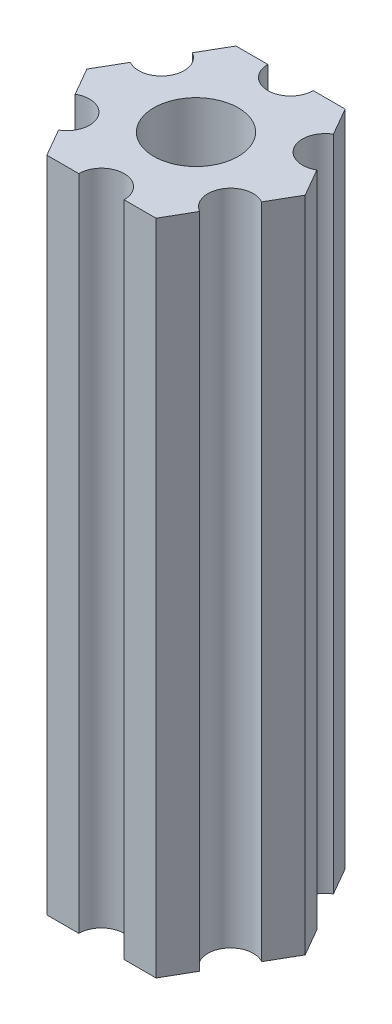
ISO-10303-21;
HEADER;
FILE_DESCRIPTION(('STEP AP214'),'2;1');
FILE_NAME('part.step','',(''),(''),'','','');
FILE_SCHEMA(('AUTOMOTIVE_DESIGN { 1 0 10303 214 1 1 1 1 }'));
ENDSEC;
DATA;
#1=APPLICATION_CONTEXT('core data for automotive mechanical design processes');
#2=APPLICATION_PROTOCOL_DEFINITION('international standard','automotive_design',2000,#1);
#3=PRODUCT_CONTEXT('',#1,'mechanical');
#4=PRODUCT('Part','Part','',(#3));
#5=PRODUCT_RELATED_PRODUCT_CATEGORY('part','',(#4));
#6=PRODUCT_DEFINITION_FORMATION('','',#4);
#7=PRODUCT_DEFINITION_CONTEXT('part definition',#1,'design');
#8=PRODUCT_DEFINITION('design','',#6,#7);
#9=PRODUCT_DEFINITION_SHAPE('','',#8);
#10=(LENGTH_UNIT() NAMED_UNIT(*) SI_UNIT(.MILLI.,.METRE.));
#11=(NAMED_UNIT(*) PLANE_ANGLE_UNIT() SI_UNIT($,.RADIAN.));
#12=(NAMED_UNIT(*) SI_UNIT($,.STERADIAN.) SOLID_ANGLE_UNIT());
#13=UNCERTAINTY_MEASURE_WITH_UNIT(LENGTH_MEASURE(1.E-05),#10,'distance_accuracy_value','');
#14=(GEOMETRIC_REPRESENTATION_CONTEXT(3) GLOBAL_UNCERTAINTY_ASSIGNED_CONTEXT((#13)) GLOBAL_UNIT_ASSIGNED_CONTEXT((#10,
#11,#12)) REPRESENTATION_CONTEXT('',''));
#15=CARTESIAN_POINT('',(0.,0.,0.));
#16=DIRECTION('',(0.,0.,1.));
#17=DIRECTION('',(1.,0.,0.));
#18=AXIS2_PLACEMENT_3D('',#15,#16,#17);
#19=CARTESIAN_POINT('',(5.41265877365274,41.5,3.125));
#20=DIRECTION('',(0.,1.,0.));
#21=DIRECTION('',(0.,0.,1.));
#22=AXIS2_PLACEMENT_3D('',#19,#20,#21);
#23=CYLINDRICAL_SURFACE('',#22,1.5);
#24=CARTESIAN_POINT('',(5.41265877365274,85.,3.125));
#25=DIRECTION('',(0.,-1.,0.));
#26=DIRECTION('',(0.,0.,-1.));
#27=AXIS2_PLACEMENT_3D('',#24,#25,#26);
#28=CIRCLE('',#27,1.5);
#29=CARTESIAN_POINT('',(4.66265877365274,85.,4.42403810567666));
#30=VERTEX_POINT('',#29);
#31=CARTESIAN_POINT('',(6.16265877365274,85.,1.82596189432335));
#32=VERTEX_POINT('',#31);
#33=EDGE_CURVE('E190',#30,#32,#28,.T.);
#34=ORIENTED_EDGE('',*,*,#33,.F.);
#35=DIRECTION('',(0.,1.,0.));
#36=VECTOR('',#35,1.);
#37=CARTESIAN_POINT('',(4.66265877365274,41.5,4.42403810567666));
#38=LINE('',#37,#36);
#39=CARTESIAN_POINT('',(4.66265877365274,41.5,4.42403810567666));
#40=VERTEX_POINT('',#39);
#41=EDGE_CURVE('E11',#40,#30,#38,.T.);
#42=ORIENTED_EDGE('',*,*,#41,.F.);
#43=CARTESIAN_POINT('',(5.41265877365274,41.5,3.125));
#44=DIRECTION('',(0.,-1.,0.));
#45=DIRECTION('',(0.,0.,-1.));
#46=AXIS2_PLACEMENT_3D('',#43,#44,#45);
#47=CIRCLE('',#46,1.5);
#48=CARTESIAN_POINT('',(6.16265877365274,41.5,1.82596189432335));
#49=VERTEX_POINT('',#48);
#50=EDGE_CURVE('E241',#40,#49,#47,.T.);
#51=ORIENTED_EDGE('',*,*,#50,.T.);
#52=DIRECTION('',(0.,1.,0.));
#53=VECTOR('',#52,1.);
#54=CARTESIAN_POINT('',(6.16265877365274,41.5,1.82596189432335));
#55=LINE('',#54,#53);
#56=EDGE_CURVE('E36',#49,#32,#55,.T.);
#57=ORIENTED_EDGE('',*,*,#56,.T.);
#58=EDGE_LOOP('',(#34,#42,#51,#57));
#59=FACE_BOUND('',#58,.T.);
#60=ADVANCED_FACE('F33',(#59),#23,.F.);
#61=CARTESIAN_POINT('',(3.60843918243516,41.5,6.25));
#62=DIRECTION('',(0.866025403784439,0.,0.5));
#63=DIRECTION('',(0.5,0.,-0.866025403784439));
#64=AXIS2_PLACEMENT_3D('',#61,#62,#63);
#65=PLANE('',#64);
#66=DIRECTION('',(0.5,0.,-0.866025403784439));
#67=VECTOR('',#66,1.);
#68=CARTESIAN_POINT('',(3.60843918243516,85.,6.25));
#69=LINE('',#68,#67);
#70=CARTESIAN_POINT('',(3.60843918243516,85.,6.25));
#71=VERTEX_POINT('',#70);
#72=EDGE_CURVE('E239',#71,#30,#69,.T.);
#73=ORIENTED_EDGE('',*,*,#72,.F.);
#74=DIRECTION('',(0.,1.,0.));
#75=VECTOR('',#74,1.);
#76=CARTESIAN_POINT('',(3.60843918243516,41.5,6.25));
#77=LINE('',#76,#75);
#78=CARTESIAN_POINT('',(3.60843918243516,41.5,6.25));
#79=VERTEX_POINT('',#78);
#80=EDGE_CURVE('E42',#79,#71,#77,.T.);
#81=ORIENTED_EDGE('',*,*,#80,.F.);
#82=DIRECTION('',(0.5,0.,-0.866025403784439));
#83=VECTOR('',#82,1.);
#84=CARTESIAN_POINT('',(3.60843918243516,41.5,6.25));
#85=LINE('',#84,#83);
#86=EDGE_CURVE('E180',#79,#40,#85,.T.);
#87=ORIENTED_EDGE('',*,*,#86,.T.);
#88=ORIENTED_EDGE('',*,*,#41,.T.);
#89=EDGE_LOOP('',(#73,#81,#87,#88));
#90=FACE_BOUND('',#89,.T.);
#91=ADVANCED_FACE('F273',(#90),#65,.T.);
#92=CARTESIAN_POINT('',(1.5,41.5,6.25));
#93=DIRECTION('',(0.,0.,1.));
#94=DIRECTION('',(1.,0.,0.));
#95=AXIS2_PLACEMENT_3D('',#92,#93,#94);
#96=PLANE('',#95);
#97=DIRECTION('',(1.,0.,0.));
#98=VECTOR('',#97,1.);
#99=CARTESIAN_POINT('',(1.5,85.,6.25));
#100=LINE('',#99,#98);
#101=CARTESIAN_POINT('',(1.5,85.,6.25));
#102=VERTEX_POINT('',#101);
#103=EDGE_CURVE('E167',#102,#71,#100,.T.);
#104=ORIENTED_EDGE('',*,*,#103,.F.);
#105=DIRECTION('',(0.,1.,0.));
#106=VECTOR('',#105,1.);
#107=CARTESIAN_POINT('',(1.5,41.5,6.25));
#108=LINE('',#107,#106);
#109=CARTESIAN_POINT('',(1.5,41.5,6.25));
#110=VERTEX_POINT('',#109);
#111=EDGE_CURVE('E162',#110,#102,#108,.T.);
#112=ORIENTED_EDGE('',*,*,#111,.F.);
#113=DIRECTION('',(1.,0.,0.));
#114=VECTOR('',#113,1.);
#115=CARTESIAN_POINT('',(1.5,41.5,6.25));
#116=LINE('',#115,#114);
#117=EDGE_CURVE('E165',#110,#79,#116,.T.);
#118=ORIENTED_EDGE('',*,*,#117,.T.);
#119=ORIENTED_EDGE('',*,*,#80,.T.);
#120=EDGE_LOOP('',(#104,#112,#118,#119));
#121=FACE_BOUND('',#120,.T.);
#122=ADVANCED_FACE('F164',(#121),#96,.T.);
#123=CARTESIAN_POINT('',(0.,41.5,6.25));
#124=DIRECTION('',(0.,1.,0.));
#125=DIRECTION('',(0.,0.,1.));
#126=AXIS2_PLACEMENT_3D('',#123,#124,#125);
#127=CYLINDRICAL_SURFACE('',#126,1.5);
#128=CARTESIAN_POINT('',(0.,85.,6.25));
#129=DIRECTION('',(0.,-1.,0.));
#130=DIRECTION('',(0.,0.,-1.));
#131=AXIS2_PLACEMENT_3D('',#128,#129,#130);
#132=CIRCLE('',#131,1.5);
#133=CARTESIAN_POINT('',(-1.5,85.,6.25));
#134=VERTEX_POINT('',#133);
#135=EDGE_CURVE('E236',#134,#102,#132,.T.);
#136=ORIENTED_EDGE('',*,*,#135,.F.);
#137=DIRECTION('',(0.,1.,0.));
#138=VECTOR('',#137,1.);
#139=CARTESIAN_POINT('',(-1.5,41.5,6.25));
#140=LINE('',#139,#138);
#141=CARTESIAN_POINT('',(-1.5,41.5,6.25));
#142=VERTEX_POINT('',#141);
#143=EDGE_CURVE('E172',#142,#134,#140,.T.);
#144=ORIENTED_EDGE('',*,*,#143,.F.);
#145=CARTESIAN_POINT('',(0.,41.5,6.25));
#146=DIRECTION('',(0.,-1.,0.));
#147=DIRECTION('',(0.,0.,-1.));
#148=AXIS2_PLACEMENT_3D('',#145,#146,#147);
#149=CIRCLE('',#148,1.5);
#150=EDGE_CURVE('E178',#142,#110,#149,.T.);
#151=ORIENTED_EDGE('',*,*,#150,.T.);
#152=ORIENTED_EDGE('',*,*,#111,.T.);
#153=EDGE_LOOP('',(#136,#144,#151,#152));
#154=FACE_BOUND('',#153,.T.);
#155=ADVANCED_FACE('F182',(#154),#127,.F.);
#156=CARTESIAN_POINT('',(-3.60843918243516,41.5,6.25));
#157=DIRECTION('',(0.,0.,1.));
#158=DIRECTION('',(1.,0.,0.));
#159=AXIS2_PLACEMENT_3D('',#156,#157,#158);
#160=PLANE('',#159);
#161=DIRECTION('',(1.,0.,0.));
#162=VECTOR('',#161,1.);
#163=CARTESIAN_POINT('',(-3.60843918243516,85.,6.25));
#164=LINE('',#163,#162);
#165=CARTESIAN_POINT('',(-3.60843918243516,85.,6.25));
#166=VERTEX_POINT('',#165);
#167=EDGE_CURVE('E233',#166,#134,#164,.T.);
#168=ORIENTED_EDGE('',*,*,#167,.F.);
#169=DIRECTION('',(0.,1.,0.));
#170=VECTOR('',#169,1.);
#171=CARTESIAN_POINT('',(-3.60843918243516,41.5,6.25));
#172=LINE('',#171,#170);
#173=CARTESIAN_POINT('',(-3.60843918243516,41.5,6.25));
#174=VERTEX_POINT('',#173);
#175=EDGE_CURVE('E245',#174,#166,#172,.T.);
#176=ORIENTED_EDGE('',*,*,#175,.F.);
#177=DIRECTION('',(1.,0.,0.));
#178=VECTOR('',#177,1.);
#179=CARTESIAN_POINT('',(-3.60843918243516,41.5,6.25));
#180=LINE('',#179,#178);
#181=EDGE_CURVE('E183',#174,#142,#180,.T.);
#182=ORIENTED_EDGE('',*,*,#181,.T.);
#183=ORIENTED_EDGE('',*,*,#143,.T.);
#184=EDGE_LOOP('',(#168,#176,#182,#183));
#185=FACE_BOUND('',#184,.T.);
#186=ADVANCED_FACE('F286',(#185),#160,.T.);
#187=CARTESIAN_POINT('',(-4.66265877365274,41.5,4.42403810567666));
#188=DIRECTION('',(-0.866025403784439,0.,0.5));
#189=DIRECTION('',(0.5,0.,0.866025403784439));
#190=AXIS2_PLACEMENT_3D('',#187,#188,#189);
#191=PLANE('',#190);
#192=DIRECTION('',(0.5,0.,0.866025403784439));
#193=VECTOR('',#192,1.);
#194=CARTESIAN_POINT('',(-4.66265877365274,85.,4.42403810567666));
#195=LINE('',#194,#193);
#196=CARTESIAN_POINT('',(-4.66265877365274,85.,4.42403810567666));
#197=VERTEX_POINT('',#196);
#198=EDGE_CURVE('E230',#197,#166,#195,.T.);
#199=ORIENTED_EDGE('',*,*,#198,.F.);
#200=DIRECTION('',(0.,1.,0.));
#201=VECTOR('',#200,1.);
#202=CARTESIAN_POINT('',(-4.66265877365274,41.5,4.42403810567666));
#203=LINE('',#202,#201);
#204=CARTESIAN_POINT('',(-4.66265877365274,41.5,4.42403810567666));
#205=VERTEX_POINT('',#204);
#206=EDGE_CURVE('E247',#205,#197,#203,.T.);
#207=ORIENTED_EDGE('',*,*,#206,.F.);
#208=DIRECTION('',(0.5,0.,0.866025403784439));
#209=VECTOR('',#208,1.);
#210=CARTESIAN_POINT('',(-4.66265877365274,41.5,4.42403810567666));
#211=LINE('',#210,#209);
#212=EDGE_CURVE('E185',#205,#174,#211,.T.);
#213=ORIENTED_EDGE('',*,*,#212,.T.);
#214=ORIENTED_EDGE('',*,*,#175,.T.);
#215=EDGE_LOOP('',(#199,#207,#213,#214));
#216=FACE_BOUND('',#215,.T.);
#217=ADVANCED_FACE('F289',(#216),#191,.T.);
#218=CARTESIAN_POINT('',(-5.41265877365274,41.5,3.125));
#219=DIRECTION('',(0.,1.,0.));
#220=DIRECTION('',(0.,0.,1.));
#221=AXIS2_PLACEMENT_3D('',#218,#219,#220);
#222=CYLINDRICAL_SURFACE('',#221,1.5);
#223=CARTESIAN_POINT('',(-5.41265877365274,85.,3.125));
#224=DIRECTION('',(0.,-1.,0.));
#225=DIRECTION('',(0.,0.,-1.));
#226=AXIS2_PLACEMENT_3D('',#223,#224,#225);
#227=CIRCLE('',#226,1.5);
#228=CARTESIAN_POINT('',(-6.16265877365274,85.,1.82596189432335));
#229=VERTEX_POINT('',#228);
#230=EDGE_CURVE('E227',#229,#197,#227,.T.);
#231=ORIENTED_EDGE('',*,*,#230,.F.);
#232=DIRECTION('',(0.,1.,0.));
#233=VECTOR('',#232,1.);
#234=CARTESIAN_POINT('',(-6.16265877365274,41.5,1.82596189432335));
#235=LINE('',#234,#233);
#236=CARTESIAN_POINT('',(-6.16265877365274,41.5,1.82596189432335));
#237=VERTEX_POINT('',#236);
#238=EDGE_CURVE('E249',#237,#229,#235,.T.);
#239=ORIENTED_EDGE('',*,*,#238,.F.);
#240=CARTESIAN_POINT('',(-5.41265877365274,41.5,3.125));
#241=DIRECTION('',(0.,-1.,0.));
#242=DIRECTION('',(0.,0.,-1.));
#243=AXIS2_PLACEMENT_3D('',#240,#241,#242);
#244=CIRCLE('',#243,1.5);
#245=EDGE_CURVE('E394',#237,#205,#244,.T.);
#246=ORIENTED_EDGE('',*,*,#245,.T.);
#247=ORIENTED_EDGE('',*,*,#206,.T.);
#248=EDGE_LOOP('',(#231,#239,#246,#247));
#249=FACE_BOUND('',#248,.T.);
#250=ADVANCED_FACE('F293',(#249),#222,.F.);
#251=CARTESIAN_POINT('',(-7.21687836487032,41.5,0.));
#252=DIRECTION('',(-0.86602540378444,0.,0.499999999999998));
#253=DIRECTION('',(0.499999999999998,0.,0.86602540378444));
#254=AXIS2_PLACEMENT_3D('',#251,#252,#253);
#255=PLANE('',#254);
#256=DIRECTION('',(0.499999999999998,0.,0.86602540378444));
#257=VECTOR('',#256,1.);
#258=CARTESIAN_POINT('',(-7.21687836487032,85.,0.));
#259=LINE('',#258,#257);
#260=CARTESIAN_POINT('',(-7.21687836487032,85.,0.));
#261=VERTEX_POINT('',#260);
#262=EDGE_CURVE('E224',#261,#229,#259,.T.);
#263=ORIENTED_EDGE('',*,*,#262,.F.);
#264=DIRECTION('',(0.,1.,0.));
#265=VECTOR('',#264,1.);
#266=CARTESIAN_POINT('',(-7.21687836487032,41.5,0.));
#267=LINE('',#266,#265);
#268=CARTESIAN_POINT('',(-7.21687836487032,41.5,0.));
#269=VERTEX_POINT('',#268);
#270=EDGE_CURVE('E251',#269,#261,#267,.T.);
#271=ORIENTED_EDGE('',*,*,#270,.F.);
#272=DIRECTION('',(0.499999999999998,0.,0.86602540378444));
#273=VECTOR('',#272,1.);
#274=CARTESIAN_POINT('',(-7.21687836487032,41.5,0.));
#275=LINE('',#274,#273);
#276=EDGE_CURVE('E391',#269,#237,#275,.T.);
#277=ORIENTED_EDGE('',*,*,#276,.T.);
#278=ORIENTED_EDGE('',*,*,#238,.T.);
#279=EDGE_LOOP('',(#263,#271,#277,#278));
#280=FACE_BOUND('',#279,.T.);
#281=ADVANCED_FACE('F297',(#280),#255,.T.);
#282=CARTESIAN_POINT('',(-6.16265877365274,41.5,-1.82596189432334));
#283=DIRECTION('',(-0.866025403784438,0.,-0.5));
#284=DIRECTION('',(-0.5,0.,0.866025403784439));
#285=AXIS2_PLACEMENT_3D('',#282,#283,#284);
#286=PLANE('',#285);
#287=DIRECTION('',(-0.5,0.,0.866025403784438));
#288=VECTOR('',#287,1.);
#289=CARTESIAN_POINT('',(-6.16265877365274,85.,-1.82596189432334));
#290=LINE('',#289,#288);
#291=CARTESIAN_POINT('',(-6.16265877365274,85.,-1.82596189432334));
#292=VERTEX_POINT('',#291);
#293=EDGE_CURVE('E221',#292,#261,#290,.T.);
#294=ORIENTED_EDGE('',*,*,#293,.F.);
#295=DIRECTION('',(0.,1.,0.));
#296=VECTOR('',#295,1.);
#297=CARTESIAN_POINT('',(-6.16265877365274,41.5,-1.82596189432334));
#298=LINE('',#297,#296);
#299=CARTESIAN_POINT('',(-6.16265877365274,41.5,-1.82596189432334));
#300=VERTEX_POINT('',#299);
#301=EDGE_CURVE('E253',#300,#292,#298,.T.);
#302=ORIENTED_EDGE('',*,*,#301,.F.);
#303=DIRECTION('',(-0.5,0.,0.866025403784438));
#304=VECTOR('',#303,1.);
#305=CARTESIAN_POINT('',(-6.16265877365274,41.5,-1.82596189432334));
#306=LINE('',#305,#304);
#307=EDGE_CURVE('E388',#300,#269,#306,.T.);
#308=ORIENTED_EDGE('',*,*,#307,.T.);
#309=ORIENTED_EDGE('',*,*,#270,.T.);
#310=EDGE_LOOP('',(#294,#302,#308,#309));
#311=FACE_BOUND('',#310,.T.);
#312=ADVANCED_FACE('F301',(#311),#286,.T.);
#313=CARTESIAN_POINT('',(-5.41265877365274,41.5,-3.125));
#314=DIRECTION('',(0.,1.,0.));
#315=DIRECTION('',(0.,0.,1.));
#316=AXIS2_PLACEMENT_3D('',#313,#314,#315);
#317=CYLINDRICAL_SURFACE('',#316,1.5);
#318=CARTESIAN_POINT('',(-5.41265877365274,85.,-3.125));
#319=DIRECTION('',(0.,-1.,0.));
#320=DIRECTION('',(0.,0.,-1.));
#321=AXIS2_PLACEMENT_3D('',#318,#319,#320);
#322=CIRCLE('',#321,1.5);
#323=CARTESIAN_POINT('',(-4.66265877365274,85.,-4.42403810567666));
#324=VERTEX_POINT('',#323);
#325=EDGE_CURVE('E218',#324,#292,#322,.T.);
#326=ORIENTED_EDGE('',*,*,#325,.F.);
#327=DIRECTION('',(0.,1.,0.));
#328=VECTOR('',#327,1.);
#329=CARTESIAN_POINT('',(-4.66265877365274,41.5,-4.42403810567666));
#330=LINE('',#329,#328);
#331=CARTESIAN_POINT('',(-4.66265877365274,41.5,-4.42403810567666));
#332=VERTEX_POINT('',#331);
#333=EDGE_CURVE('E255',#332,#324,#330,.T.);
#334=ORIENTED_EDGE('',*,*,#333,.F.);
#335=CARTESIAN_POINT('',(-5.41265877365274,41.5,-3.125));
#336=DIRECTION('',(0.,-1.,0.));
#337=DIRECTION('',(0.,0.,-1.));
#338=AXIS2_PLACEMENT_3D('',#335,#336,#337);
#339=CIRCLE('',#338,1.5);
#340=EDGE_CURVE('E385',#332,#300,#339,.T.);
#341=ORIENTED_EDGE('',*,*,#340,.T.);
#342=ORIENTED_EDGE('',*,*,#301,.T.);
#343=EDGE_LOOP('',(#326,#334,#341,#342));
#344=FACE_BOUND('',#343,.T.);
#345=ADVANCED_FACE('F305',(#344),#317,.F.);
#346=CARTESIAN_POINT('',(-3.60843918243516,41.5,-6.25));
#347=DIRECTION('',(-0.866025403784439,0.,-0.5));
#348=DIRECTION('',(-0.5,0.,0.866025403784439));
#349=AXIS2_PLACEMENT_3D('',#346,#347,#348);
#350=PLANE('',#349);
#351=DIRECTION('',(-0.5,0.,0.866025403784439));
#352=VECTOR('',#351,1.);
#353=CARTESIAN_POINT('',(-3.60843918243516,85.,-6.25));
#354=LINE('',#353,#352);
#355=CARTESIAN_POINT('',(-3.60843918243516,85.,-6.25));
#356=VERTEX_POINT('',#355);
#357=EDGE_CURVE('E215',#356,#324,#354,.T.);
#358=ORIENTED_EDGE('',*,*,#357,.F.);
#359=DIRECTION('',(0.,1.,0.));
#360=VECTOR('',#359,1.);
#361=CARTESIAN_POINT('',(-3.60843918243516,41.5,-6.25));
#362=LINE('',#361,#360);
#363=CARTESIAN_POINT('',(-3.60843918243516,41.5,-6.25));
#364=VERTEX_POINT('',#363);
#365=EDGE_CURVE('E257',#364,#356,#362,.T.);
#366=ORIENTED_EDGE('',*,*,#365,.F.);
#367=DIRECTION('',(-0.5,0.,0.866025403784439));
#368=VECTOR('',#367,1.);
#369=CARTESIAN_POINT('',(-3.60843918243516,41.5,-6.25));
#370=LINE('',#369,#368);
#371=EDGE_CURVE('E382',#364,#332,#370,.T.);
#372=ORIENTED_EDGE('',*,*,#371,.T.);
#373=ORIENTED_EDGE('',*,*,#333,.T.);
#374=EDGE_LOOP('',(#358,#366,#372,#373));
#375=FACE_BOUND('',#374,.T.);
#376=ADVANCED_FACE('F309',(#375),#350,.T.);
#377=CARTESIAN_POINT('',(-1.5,41.5,-6.25));
#378=DIRECTION('',(0.,0.,-1.));
#379=DIRECTION('',(-1.,0.,0.));
#380=AXIS2_PLACEMENT_3D('',#377,#378,#379);
#381=PLANE('',#380);
#382=DIRECTION('',(-1.,0.,0.));
#383=VECTOR('',#382,1.);
#384=CARTESIAN_POINT('',(-1.5,85.,-6.25));
#385=LINE('',#384,#383);
#386=CARTESIAN_POINT('',(-1.5,85.,-6.25));
#387=VERTEX_POINT('',#386);
#388=EDGE_CURVE('E212',#387,#356,#385,.T.);
#389=ORIENTED_EDGE('',*,*,#388,.F.);
#390=DIRECTION('',(0.,1.,0.));
#391=VECTOR('',#390,1.);
#392=CARTESIAN_POINT('',(-1.5,41.5,-6.25));
#393=LINE('',#392,#391);
#394=CARTESIAN_POINT('',(-1.5,41.5,-6.25));
#395=VERTEX_POINT('',#394);
#396=EDGE_CURVE('E259',#395,#387,#393,.T.);
#397=ORIENTED_EDGE('',*,*,#396,.F.);
#398=DIRECTION('',(-1.,0.,0.));
#399=VECTOR('',#398,1.);
#400=CARTESIAN_POINT('',(-1.5,41.5,-6.25));
#401=LINE('',#400,#399);
#402=EDGE_CURVE('E379',#395,#364,#401,.T.);
#403=ORIENTED_EDGE('',*,*,#402,.T.);
#404=ORIENTED_EDGE('',*,*,#365,.T.);
#405=EDGE_LOOP('',(#389,#397,#403,#404));
#406=FACE_BOUND('',#405,.T.);
#407=ADVANCED_FACE('F313',(#406),#381,.T.);
#408=CARTESIAN_POINT('',(0.,41.5,-6.25));
#409=DIRECTION('',(0.,1.,0.));
#410=DIRECTION('',(0.,0.,1.));
#411=AXIS2_PLACEMENT_3D('',#408,#409,#410);
#412=CYLINDRICAL_SURFACE('',#411,1.5);
#413=CARTESIAN_POINT('',(0.,85.,-6.25));
#414=DIRECTION('',(0.,-1.,0.));
#415=DIRECTION('',(0.,0.,-1.));
#416=AXIS2_PLACEMENT_3D('',#413,#414,#415);
#417=CIRCLE('',#416,1.5);
#418=CARTESIAN_POINT('',(1.5,85.,-6.25));
#419=VERTEX_POINT('',#418);
#420=EDGE_CURVE('E209',#419,#387,#417,.T.);
#421=ORIENTED_EDGE('',*,*,#420,.F.);
#422=DIRECTION('',(0.,1.,0.));
#423=VECTOR('',#422,1.);
#424=CARTESIAN_POINT('',(1.5,41.5,-6.25));
#425=LINE('',#424,#423);
#426=CARTESIAN_POINT('',(1.5,41.5,-6.25));
#427=VERTEX_POINT('',#426);
#428=EDGE_CURVE('E261',#427,#419,#425,.T.);
#429=ORIENTED_EDGE('',*,*,#428,.F.);
#430=CARTESIAN_POINT('',(0.,41.5,-6.25));
#431=DIRECTION('',(0.,-1.,0.));
#432=DIRECTION('',(0.,0.,-1.));
#433=AXIS2_PLACEMENT_3D('',#430,#431,#432);
#434=CIRCLE('',#433,1.5);
#435=EDGE_CURVE('E376',#427,#395,#434,.T.);
#436=ORIENTED_EDGE('',*,*,#435,.T.);
#437=ORIENTED_EDGE('',*,*,#396,.T.);
#438=EDGE_LOOP('',(#421,#429,#436,#437));
#439=FACE_BOUND('',#438,.T.);
#440=ADVANCED_FACE('F317',(#439),#412,.F.);
#441=CARTESIAN_POINT('',(3.60843918243516,41.5,-6.25));
#442=DIRECTION('',(0.,0.,-1.));
#443=DIRECTION('',(-1.,0.,0.));
#444=AXIS2_PLACEMENT_3D('',#441,#442,#443);
#445=PLANE('',#444);
#446=DIRECTION('',(-1.,0.,0.));
#447=VECTOR('',#446,1.);
#448=CARTESIAN_POINT('',(3.60843918243516,85.,-6.25));
#449=LINE('',#448,#447);
#450=CARTESIAN_POINT('',(3.60843918243516,85.,-6.25));
#451=VERTEX_POINT('',#450);
#452=EDGE_CURVE('E206',#451,#419,#449,.T.);
#453=ORIENTED_EDGE('',*,*,#452,.F.);
#454=DIRECTION('',(0.,1.,0.));
#455=VECTOR('',#454,1.);
#456=CARTESIAN_POINT('',(3.60843918243516,41.5,-6.25));
#457=LINE('',#456,#455);
#458=CARTESIAN_POINT('',(3.60843918243516,41.5,-6.25));
#459=VERTEX_POINT('',#458);
#460=EDGE_CURVE('E263',#459,#451,#457,.T.);
#461=ORIENTED_EDGE('',*,*,#460,.F.);
#462=DIRECTION('',(-1.,0.,0.));
#463=VECTOR('',#462,1.);
#464=CARTESIAN_POINT('',(3.60843918243516,41.5,-6.25));
#465=LINE('',#464,#463);
#466=EDGE_CURVE('E373',#459,#427,#465,.T.);
#467=ORIENTED_EDGE('',*,*,#466,.T.);
#468=ORIENTED_EDGE('',*,*,#428,.T.);
#469=EDGE_LOOP('',(#453,#461,#467,#468));
#470=FACE_BOUND('',#469,.T.);
#471=ADVANCED_FACE('F321',(#470),#445,.T.);
#472=CARTESIAN_POINT('',(4.66265877365274,41.5,-4.42403810567666));
#473=DIRECTION('',(0.866025403784439,0.,-0.5));
#474=DIRECTION('',(-0.5,0.,-0.866025403784439));
#475=AXIS2_PLACEMENT_3D('',#472,#473,#474);
#476=PLANE('',#475);
#477=DIRECTION('',(-0.5,0.,-0.866025403784439));
#478=VECTOR('',#477,1.);
#479=CARTESIAN_POINT('',(4.66265877365274,85.,-4.42403810567666));
#480=LINE('',#479,#478);
#481=CARTESIAN_POINT('',(4.66265877365274,85.,-4.42403810567666));
#482=VERTEX_POINT('',#481);
#483=EDGE_CURVE('E203',#482,#451,#480,.T.);
#484=ORIENTED_EDGE('',*,*,#483,.F.);
#485=DIRECTION('',(0.,1.,0.));
#486=VECTOR('',#485,1.);
#487=CARTESIAN_POINT('',(4.66265877365274,41.5,-4.42403810567666));
#488=LINE('',#487,#486);
#489=CARTESIAN_POINT('',(4.66265877365274,41.5,-4.42403810567666));
#490=VERTEX_POINT('',#489);
#491=EDGE_CURVE('E265',#490,#482,#488,.T.);
#492=ORIENTED_EDGE('',*,*,#491,.F.);
#493=DIRECTION('',(-0.5,0.,-0.866025403784439));
#494=VECTOR('',#493,1.);
#495=CARTESIAN_POINT('',(4.66265877365274,41.5,-4.42403810567666));
#496=LINE('',#495,#494);
#497=EDGE_CURVE('E370',#490,#459,#496,.T.);
#498=ORIENTED_EDGE('',*,*,#497,.T.);
#499=ORIENTED_EDGE('',*,*,#460,.T.);
#500=EDGE_LOOP('',(#484,#492,#498,#499));
#501=FACE_BOUND('',#500,.T.);
#502=ADVANCED_FACE('F325',(#501),#476,.T.);
#503=CARTESIAN_POINT('',(5.41265877365274,41.5,-3.125));
#504=DIRECTION('',(0.,1.,0.));
#505=DIRECTION('',(0.,0.,1.));
#506=AXIS2_PLACEMENT_3D('',#503,#504,#505);
#507=CYLINDRICAL_SURFACE('',#506,1.5);
#508=CARTESIAN_POINT('',(5.41265877365274,85.,-3.125));
#509=DIRECTION('',(0.,-1.,0.));
#510=DIRECTION('',(0.,0.,-1.));
#511=AXIS2_PLACEMENT_3D('',#508,#509,#510);
#512=CIRCLE('',#511,1.5);
#513=CARTESIAN_POINT('',(6.16265877365274,85.,-1.82596189432334));
#514=VERTEX_POINT('',#513);
#515=EDGE_CURVE('E200',#514,#482,#512,.T.);
#516=ORIENTED_EDGE('',*,*,#515,.F.);
#517=DIRECTION('',(0.,1.,0.));
#518=VECTOR('',#517,1.);
#519=CARTESIAN_POINT('',(6.16265877365274,41.5,-1.82596189432334));
#520=LINE('',#519,#518);
#521=CARTESIAN_POINT('',(6.16265877365274,41.5,-1.82596189432334));
#522=VERTEX_POINT('',#521);
#523=EDGE_CURVE('E267',#522,#514,#520,.T.);
#524=ORIENTED_EDGE('',*,*,#523,.F.);
#525=CARTESIAN_POINT('',(5.41265877365274,41.5,-3.125));
#526=DIRECTION('',(0.,-1.,0.));
#527=DIRECTION('',(0.,0.,-1.));
#528=AXIS2_PLACEMENT_3D('',#525,#526,#527);
#529=CIRCLE('',#528,1.5);
#530=EDGE_CURVE('E367',#522,#490,#529,.T.);
#531=ORIENTED_EDGE('',*,*,#530,.T.);
#532=ORIENTED_EDGE('',*,*,#491,.T.);
#533=EDGE_LOOP('',(#516,#524,#531,#532));
#534=FACE_BOUND('',#533,.T.);
#535=ADVANCED_FACE('F329',(#534),#507,.F.);
#536=CARTESIAN_POINT('',(7.21687836487032,41.5,0.));
#537=DIRECTION('',(0.866025403784439,0.,-0.5));
#538=DIRECTION('',(-0.5,0.,-0.866025403784439));
#539=AXIS2_PLACEMENT_3D('',#536,#537,#538);
#540=PLANE('',#539);
#541=DIRECTION('',(-0.5,0.,-0.866025403784439));
#542=VECTOR('',#541,1.);
#543=CARTESIAN_POINT('',(7.21687836487032,85.,0.));
#544=LINE('',#543,#542);
#545=CARTESIAN_POINT('',(7.21687836487032,85.,0.));
#546=VERTEX_POINT('',#545);
#547=EDGE_CURVE('E197',#546,#514,#544,.T.);
#548=ORIENTED_EDGE('',*,*,#547,.F.);
#549=DIRECTION('',(0.,1.,0.));
#550=VECTOR('',#549,1.);
#551=CARTESIAN_POINT('',(7.21687836487032,41.5,0.));
#552=LINE('',#551,#550);
#553=CARTESIAN_POINT('',(7.21687836487032,41.5,0.));
#554=VERTEX_POINT('',#553);
#555=EDGE_CURVE('E268',#554,#546,#552,.T.);
#556=ORIENTED_EDGE('',*,*,#555,.F.);
#557=DIRECTION('',(-0.5,0.,-0.866025403784439));
#558=VECTOR('',#557,1.);
#559=CARTESIAN_POINT('',(7.21687836487032,41.5,0.));
#560=LINE('',#559,#558);
#561=EDGE_CURVE('E364',#554,#522,#560,.T.);
#562=ORIENTED_EDGE('',*,*,#561,.T.);
#563=ORIENTED_EDGE('',*,*,#523,.T.);
#564=EDGE_LOOP('',(#548,#556,#562,#563));
#565=FACE_BOUND('',#564,.T.);
#566=ADVANCED_FACE('F333',(#565),#540,.T.);
#567=CARTESIAN_POINT('',(6.16265877365274,41.5,1.82596189432335));
#568=DIRECTION('',(0.866025403784439,0.,0.499999999999999));
#569=DIRECTION('',(0.499999999999999,0.,-0.86602540378444));
#570=AXIS2_PLACEMENT_3D('',#567,#568,#569);
#571=PLANE('',#570);
#572=DIRECTION('',(0.499999999999999,0.,-0.86602540378444));
#573=VECTOR('',#572,1.);
#574=CARTESIAN_POINT('',(6.16265877365274,85.,1.82596189432335));
#575=LINE('',#574,#573);
#576=EDGE_CURVE('E193',#32,#546,#575,.T.);
#577=ORIENTED_EDGE('',*,*,#576,.F.);
#578=ORIENTED_EDGE('',*,*,#56,.F.);
#579=DIRECTION('',(0.499999999999999,0.,-0.86602540378444));
#580=VECTOR('',#579,1.);
#581=CARTESIAN_POINT('',(6.16265877365274,41.5,1.82596189432335));
#582=LINE('',#581,#580);
#583=EDGE_CURVE('E362',#49,#554,#582,.T.);
#584=ORIENTED_EDGE('',*,*,#583,.T.);
#585=ORIENTED_EDGE('',*,*,#555,.T.);
#586=EDGE_LOOP('',(#577,#578,#584,#585));
#587=FACE_BOUND('',#586,.T.);
#588=ADVANCED_FACE('F270',(#587),#571,.T.);
#589=CARTESIAN_POINT('',(5.41265877365274,41.5,3.125));
#590=DIRECTION('',(0.,-1.,0.));
#591=DIRECTION('',(0.,0.,-1.));
#592=AXIS2_PLACEMENT_3D('',#589,#590,#591);
#593=PLANE('',#592);
#594=CARTESIAN_POINT('',(0.,41.5,0.));
#595=DIRECTION('',(0.,1.,0.));
#596=DIRECTION('',(0.,0.,-1.));
#597=AXIS2_PLACEMENT_3D('',#594,#595,#596);
#598=CIRCLE('',#597,2.79);
#599=CARTESIAN_POINT('',(0.,41.5,-2.79));
#600=VERTEX_POINT('',#599);
#601=EDGE_CURVE('E194',#600,#600,#598,.T.);
#602=ORIENTED_EDGE('',*,*,#601,.T.);
#603=EDGE_LOOP('',(#602));
#604=FACE_BOUND('',#603,.T.);
#605=ORIENTED_EDGE('',*,*,#50,.F.);
#606=ORIENTED_EDGE('',*,*,#86,.F.);
#607=ORIENTED_EDGE('',*,*,#117,.F.);
#608=ORIENTED_EDGE('',*,*,#150,.F.);
#609=ORIENTED_EDGE('',*,*,#181,.F.);
#610=ORIENTED_EDGE('',*,*,#212,.F.);
#611=ORIENTED_EDGE('',*,*,#245,.F.);
#612=ORIENTED_EDGE('',*,*,#276,.F.);
#613=ORIENTED_EDGE('',*,*,#307,.F.);
#614=ORIENTED_EDGE('',*,*,#340,.F.);
#615=ORIENTED_EDGE('',*,*,#371,.F.);
#616=ORIENTED_EDGE('',*,*,#402,.F.);
#617=ORIENTED_EDGE('',*,*,#435,.F.);
#618=ORIENTED_EDGE('',*,*,#466,.F.);
#619=ORIENTED_EDGE('',*,*,#497,.F.);
#620=ORIENTED_EDGE('',*,*,#530,.F.);
#621=ORIENTED_EDGE('',*,*,#561,.F.);
#622=ORIENTED_EDGE('',*,*,#583,.F.);
#623=EDGE_LOOP('',(#605,#606,#607,#608,#609,#610,#611,#612,#613,#614,#615,#616,#617,#618,#619,
#620,#621,#622));
#624=FACE_BOUND('',#623,.T.);
#625=ADVANCED_FACE('F176',(#604,#624),#593,.T.);
#626=CARTESIAN_POINT('',(5.41265877365274,85.,3.125));
#627=DIRECTION('',(0.,-1.,0.));
#628=DIRECTION('',(0.,0.,-1.));
#629=AXIS2_PLACEMENT_3D('',#626,#627,#628);
#630=PLANE('',#629);
#631=CARTESIAN_POINT('',(0.,85.,0.));
#632=DIRECTION('',(0.,1.,0.));
#633=DIRECTION('',(0.,0.,-1.));
#634=AXIS2_PLACEMENT_3D('',#631,#632,#633);
#635=CIRCLE('',#634,2.79);
#636=CARTESIAN_POINT('',(0.,85.,-2.79));
#637=VERTEX_POINT('',#636);
#638=EDGE_CURVE('E357',#637,#637,#635,.T.);
#639=ORIENTED_EDGE('',*,*,#638,.F.);
#640=EDGE_LOOP('',(#639));
#641=FACE_BOUND('',#640,.T.);
#642=ORIENTED_EDGE('',*,*,#33,.T.);
#643=ORIENTED_EDGE('',*,*,#576,.T.);
#644=ORIENTED_EDGE('',*,*,#547,.T.);
#645=ORIENTED_EDGE('',*,*,#515,.T.);
#646=ORIENTED_EDGE('',*,*,#483,.T.);
#647=ORIENTED_EDGE('',*,*,#452,.T.);
#648=ORIENTED_EDGE('',*,*,#420,.T.);
#649=ORIENTED_EDGE('',*,*,#388,.T.);
#650=ORIENTED_EDGE('',*,*,#357,.T.);
#651=ORIENTED_EDGE('',*,*,#325,.T.);
#652=ORIENTED_EDGE('',*,*,#293,.T.);
#653=ORIENTED_EDGE('',*,*,#262,.T.);
#654=ORIENTED_EDGE('',*,*,#230,.T.);
#655=ORIENTED_EDGE('',*,*,#198,.T.);
#656=ORIENTED_EDGE('',*,*,#167,.T.);
#657=ORIENTED_EDGE('',*,*,#135,.T.);
#658=ORIENTED_EDGE('',*,*,#103,.T.);
#659=ORIENTED_EDGE('',*,*,#72,.T.);
#660=EDGE_LOOP('',(#642,#643,#644,#645,#646,#647,#648,#649,#650,#651,#652,#653,#654,#655,#656,
#657,#658,#659));
#661=FACE_BOUND('',#660,.T.);
#662=ADVANCED_FACE('F272',(#641,#661),#630,.F.);
#663=CARTESIAN_POINT('',(0.,41.5,0.));
#664=DIRECTION('',(0.,1.,0.));
#665=DIRECTION('',(0.,0.,1.));
#666=AXIS2_PLACEMENT_3D('',#663,#664,#665);
#667=CYLINDRICAL_SURFACE('',#666,2.79);
#668=ORIENTED_EDGE('',*,*,#601,.F.);
#669=EDGE_LOOP('',(#668));
#670=FACE_BOUND('',#669,.T.);
#671=ORIENTED_EDGE('',*,*,#638,.T.);
#672=EDGE_LOOP('',(#671));
#673=FACE_BOUND('',#672,.T.);
#674=ADVANCED_FACE('F345',(#670,#673),#667,.F.);
#675=CLOSED_SHELL('',(#60,#91,#122,#155,#186,#217,#250,#281,#312,#345,#376,#407,#440,#471,#502,
#535,#566,#588,#625,#662,#674));
#676=MANIFOLD_SOLID_BREP('B2',#675);
#677=ADVANCED_BREP_SHAPE_REPRESENTATION('',(#18,#676),#14);
#678=SHAPE_DEFINITION_REPRESENTATION(#9,#677);
ENDSEC;
END-ISO-10303-21;
